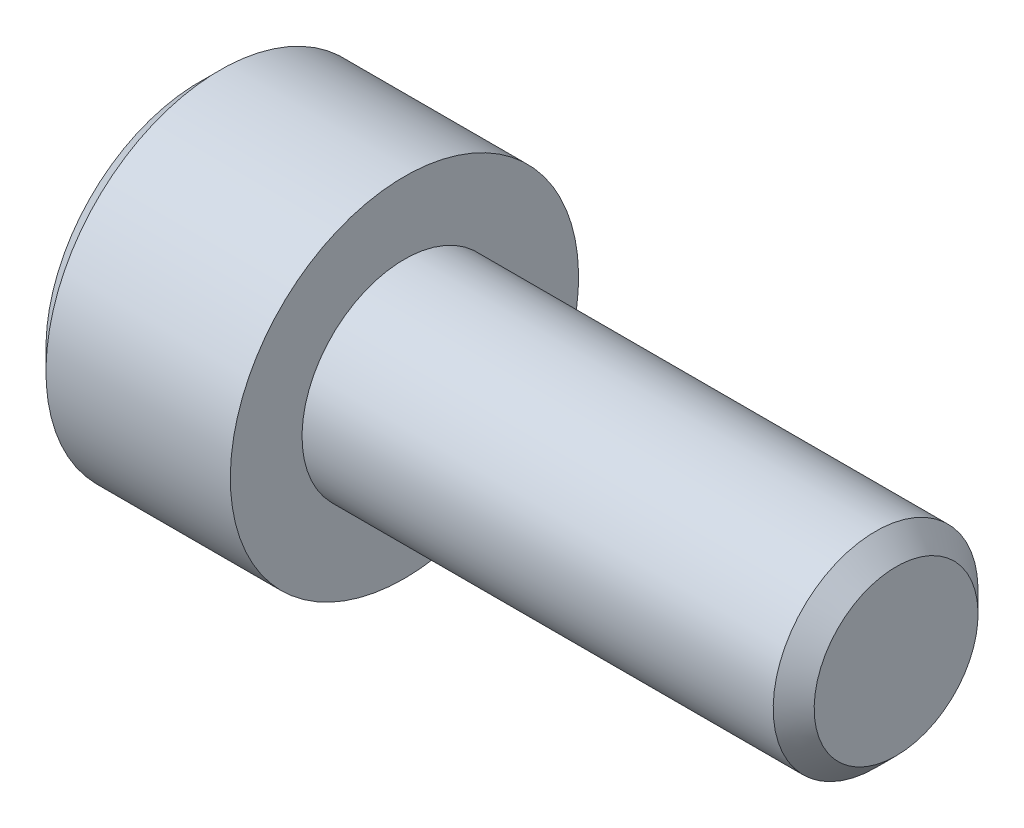
ISO-10303-21;
HEADER;
FILE_DESCRIPTION(('STEP AP214'),'2;1');
FILE_NAME('part.step','',(''),(''),'','','');
FILE_SCHEMA(('AUTOMOTIVE_DESIGN { 1 0 10303 214 1 1 1 1 }'));
ENDSEC;
DATA;
#1=APPLICATION_CONTEXT('core data for automotive mechanical design processes');
#2=APPLICATION_PROTOCOL_DEFINITION('international standard','automotive_design',2000,#1);
#3=PRODUCT_CONTEXT('',#1,'mechanical');
#4=PRODUCT('Part','Part','',(#3));
#5=PRODUCT_RELATED_PRODUCT_CATEGORY('part','',(#4));
#6=PRODUCT_DEFINITION_FORMATION('','',#4);
#7=PRODUCT_DEFINITION_CONTEXT('part definition',#1,'design');
#8=PRODUCT_DEFINITION('design','',#6,#7);
#9=PRODUCT_DEFINITION_SHAPE('','',#8);
#10=(LENGTH_UNIT() NAMED_UNIT(*) SI_UNIT(.MILLI.,.METRE.));
#11=(NAMED_UNIT(*) PLANE_ANGLE_UNIT() SI_UNIT($,.RADIAN.));
#12=(NAMED_UNIT(*) SI_UNIT($,.STERADIAN.) SOLID_ANGLE_UNIT());
#13=UNCERTAINTY_MEASURE_WITH_UNIT(LENGTH_MEASURE(1.E-05),#10,'distance_accuracy_value','');
#14=(GEOMETRIC_REPRESENTATION_CONTEXT(3) GLOBAL_UNCERTAINTY_ASSIGNED_CONTEXT((#13)) GLOBAL_UNIT_ASSIGNED_CONTEXT((#10,
#11,#12)) REPRESENTATION_CONTEXT('',''));
#15=CARTESIAN_POINT('',(0.,0.,0.));
#16=DIRECTION('',(0.,0.,1.));
#17=DIRECTION('',(1.,0.,0.));
#18=AXIS2_PLACEMENT_3D('',#15,#16,#17);
#19=CARTESIAN_POINT('',(-5.,0.,0.));
#20=DIRECTION('',(1.,0.,0.));
#21=DIRECTION('',(0.,1.,0.));
#22=AXIS2_PLACEMENT_3D('',#19,#20,#21);
#23=PLANE('',#22);
#24=CARTESIAN_POINT('',(-5.,0.,0.));
#25=DIRECTION('',(-1.,0.,0.));
#26=DIRECTION('',(0.,-1.,0.));
#27=AXIS2_PLACEMENT_3D('',#24,#25,#26);
#28=CIRCLE('',#27,3.75);
#29=CARTESIAN_POINT('',(-5.,-3.75,0.));
#30=VERTEX_POINT('',#29);
#31=EDGE_CURVE('E158',#30,#30,#28,.T.);
#32=ORIENTED_EDGE('',*,*,#31,.T.);
#33=EDGE_LOOP('',(#32));
#34=FACE_BOUND('',#33,.T.);
#35=DIRECTION('',(0.,-0.499999999999983,-0.866025403784448));
#36=VECTOR('',#35,1.);
#37=CARTESIAN_POINT('',(-5.,-1.1547005383793,2.));
#38=LINE('',#37,#36);
#39=CARTESIAN_POINT('',(-5.,-1.1547005383793,2.));
#40=VERTEX_POINT('',#39);
#41=CARTESIAN_POINT('',(-5.,-2.3094010767585,0.));
#42=VERTEX_POINT('',#41);
#43=EDGE_CURVE('E274',#40,#42,#38,.T.);
#44=ORIENTED_EDGE('',*,*,#43,.T.);
#45=DIRECTION('',(0.,0.499999999999983,-0.866025403784448));
#46=VECTOR('',#45,1.);
#47=CARTESIAN_POINT('',(-5.,-2.3094010767585,0.));
#48=LINE('',#47,#46);
#49=CARTESIAN_POINT('',(-5.,-1.1547005383793,-2.));
#50=VERTEX_POINT('',#49);
#51=EDGE_CURVE('E276',#42,#50,#48,.T.);
#52=ORIENTED_EDGE('',*,*,#51,.T.);
#53=DIRECTION('',(0.,1.,0.));
#54=VECTOR('',#53,1.);
#55=CARTESIAN_POINT('',(-5.,-1.1547005383793,-2.));
#56=LINE('',#55,#54);
#57=CARTESIAN_POINT('',(-5.,1.1547005383793,-2.));
#58=VERTEX_POINT('',#57);
#59=EDGE_CURVE('E278',#50,#58,#56,.T.);
#60=ORIENTED_EDGE('',*,*,#59,.T.);
#61=DIRECTION('',(0.,0.499999999999983,0.866025403784448));
#62=VECTOR('',#61,1.);
#63=CARTESIAN_POINT('',(-5.,1.1547005383793,-2.));
#64=LINE('',#63,#62);
#65=CARTESIAN_POINT('',(-5.,2.3094010767585,0.));
#66=VERTEX_POINT('',#65);
#67=EDGE_CURVE('E123',#58,#66,#64,.T.);
#68=ORIENTED_EDGE('',*,*,#67,.T.);
#69=DIRECTION('',(0.,-0.499999999999983,0.866025403784448));
#70=VECTOR('',#69,1.);
#71=CARTESIAN_POINT('',(-5.,2.3094010767585,0.));
#72=LINE('',#71,#70);
#73=CARTESIAN_POINT('',(-5.,1.1547005383793,2.));
#74=VERTEX_POINT('',#73);
#75=EDGE_CURVE('E271',#66,#74,#72,.T.);
#76=ORIENTED_EDGE('',*,*,#75,.T.);
#77=DIRECTION('',(0.,-1.,0.));
#78=VECTOR('',#77,1.);
#79=CARTESIAN_POINT('',(-5.,1.1547005383793,2.));
#80=LINE('',#79,#78);
#81=EDGE_CURVE('E138',#74,#40,#80,.T.);
#82=ORIENTED_EDGE('',*,*,#81,.T.);
#83=EDGE_LOOP('',(#44,#52,#60,#68,#76,#82));
#84=FACE_BOUND('',#83,.T.);
#85=ADVANCED_FACE('F39',(#34,#84),#23,.F.);
#86=CARTESIAN_POINT('',(-4.5,0.,0.));
#87=DIRECTION('',(1.,0.,0.));
#88=DIRECTION('',(0.,1.,0.));
#89=AXIS2_PLACEMENT_3D('',#86,#87,#88);
#90=CONICAL_SURFACE('',#89,4.25,0.785398163397448);
#91=ORIENTED_EDGE('',*,*,#31,.F.);
#92=EDGE_LOOP('',(#91));
#93=FACE_BOUND('',#92,.T.);
#94=CARTESIAN_POINT('',(-4.5,0.,0.));
#95=DIRECTION('',(-1.,0.,0.));
#96=DIRECTION('',(0.,-1.,0.));
#97=AXIS2_PLACEMENT_3D('',#94,#95,#96);
#98=CIRCLE('',#97,4.25);
#99=CARTESIAN_POINT('',(-4.5,-4.25,0.));
#100=VERTEX_POINT('',#99);
#101=EDGE_CURVE('E155',#100,#100,#98,.T.);
#102=ORIENTED_EDGE('',*,*,#101,.T.);
#103=EDGE_LOOP('',(#102));
#104=FACE_BOUND('',#103,.T.);
#105=ADVANCED_FACE('F178',(#93,#104),#90,.T.);
#106=CARTESIAN_POINT('',(12.,0.,0.));
#107=DIRECTION('',(-1.,0.,0.));
#108=DIRECTION('',(0.,-1.,0.));
#109=AXIS2_PLACEMENT_3D('',#106,#107,#108);
#110=CYLINDRICAL_SURFACE('',#109,4.25);
#111=ORIENTED_EDGE('',*,*,#101,.F.);
#112=EDGE_LOOP('',(#111));
#113=FACE_BOUND('',#112,.T.);
#114=CARTESIAN_POINT('',(0.,0.,0.));
#115=DIRECTION('',(-1.,0.,0.));
#116=DIRECTION('',(0.,-1.,0.));
#117=AXIS2_PLACEMENT_3D('',#114,#115,#116);
#118=CIRCLE('',#117,4.25);
#119=CARTESIAN_POINT('',(0.,-4.25,0.));
#120=VERTEX_POINT('',#119);
#121=EDGE_CURVE('E152',#120,#120,#118,.T.);
#122=ORIENTED_EDGE('',*,*,#121,.T.);
#123=EDGE_LOOP('',(#122));
#124=FACE_BOUND('',#123,.T.);
#125=ADVANCED_FACE('F183',(#113,#124),#110,.T.);
#126=CARTESIAN_POINT('',(0.,4.25,0.));
#127=DIRECTION('',(-1.,0.,0.));
#128=DIRECTION('',(0.,-1.,0.));
#129=AXIS2_PLACEMENT_3D('',#126,#127,#128);
#130=PLANE('',#129);
#131=ORIENTED_EDGE('',*,*,#121,.F.);
#132=EDGE_LOOP('',(#131));
#133=FACE_BOUND('',#132,.T.);
#134=CARTESIAN_POINT('',(0.,0.,0.));
#135=DIRECTION('',(-1.,0.,0.));
#136=DIRECTION('',(0.,-1.,0.));
#137=AXIS2_PLACEMENT_3D('',#134,#135,#136);
#138=CIRCLE('',#137,2.5);
#139=CARTESIAN_POINT('',(0.,-2.5,0.));
#140=VERTEX_POINT('',#139);
#141=EDGE_CURVE('E148',#140,#140,#138,.T.);
#142=ORIENTED_EDGE('',*,*,#141,.T.);
#143=EDGE_LOOP('',(#142));
#144=FACE_BOUND('',#143,.T.);
#145=ADVANCED_FACE('F190',(#133,#144),#130,.F.);
#146=CARTESIAN_POINT('',(12.,0.,0.));
#147=DIRECTION('',(-1.,0.,0.));
#148=DIRECTION('',(0.,-1.,0.));
#149=AXIS2_PLACEMENT_3D('',#146,#147,#148);
#150=CYLINDRICAL_SURFACE('',#149,2.5);
#151=CARTESIAN_POINT('',(11.5,0.,0.));
#152=DIRECTION('',(-1.,0.,0.));
#153=DIRECTION('',(0.,-1.,0.));
#154=AXIS2_PLACEMENT_3D('',#151,#152,#153);
#155=CIRCLE('',#154,2.5);
#156=CARTESIAN_POINT('',(11.5,-2.5,0.));
#157=VERTEX_POINT('',#156);
#158=EDGE_CURVE('E47',#157,#157,#155,.T.);
#159=ORIENTED_EDGE('',*,*,#158,.T.);
#160=EDGE_LOOP('',(#159));
#161=FACE_BOUND('',#160,.T.);
#162=ORIENTED_EDGE('',*,*,#141,.F.);
#163=EDGE_LOOP('',(#162));
#164=FACE_BOUND('',#163,.T.);
#165=ADVANCED_FACE('F163',(#161,#164),#150,.T.);
#166=CARTESIAN_POINT('',(12.,2.5,0.));
#167=DIRECTION('',(-1.,0.,0.));
#168=DIRECTION('',(0.,-1.,0.));
#169=AXIS2_PLACEMENT_3D('',#166,#167,#168);
#170=PLANE('',#169);
#171=CARTESIAN_POINT('',(12.,0.,0.));
#172=DIRECTION('',(-1.,0.,0.));
#173=DIRECTION('',(0.,-1.,0.));
#174=AXIS2_PLACEMENT_3D('',#171,#172,#173);
#175=CIRCLE('',#174,2.);
#176=CARTESIAN_POINT('',(12.,-2.,0.));
#177=VERTEX_POINT('',#176);
#178=EDGE_CURVE('E11',#177,#177,#175,.F.);
#179=ORIENTED_EDGE('',*,*,#178,.T.);
#180=EDGE_LOOP('',(#179));
#181=FACE_BOUND('',#180,.T.);
#182=ADVANCED_FACE('F167',(#181),#170,.F.);
#183=CARTESIAN_POINT('',(11.5,0.,0.));
#184=DIRECTION('',(-1.,0.,0.));
#185=DIRECTION('',(0.,-1.,0.));
#186=AXIS2_PLACEMENT_3D('',#183,#184,#185);
#187=CONICAL_SURFACE('',#186,2.5,0.78539816339745);
#188=ORIENTED_EDGE('',*,*,#178,.F.);
#189=EDGE_LOOP('',(#188));
#190=FACE_BOUND('',#189,.T.);
#191=ORIENTED_EDGE('',*,*,#158,.F.);
#192=EDGE_LOOP('',(#191));
#193=FACE_BOUND('',#192,.T.);
#194=ADVANCED_FACE('F41',(#190,#193),#187,.T.);
#195=CARTESIAN_POINT('',(-2.5,2.3094010767585,0.));
#196=DIRECTION('',(0.,-0.866025403784448,-0.499999999999983));
#197=DIRECTION('',(0.,0.499999999999983,-0.866025403784448));
#198=AXIS2_PLACEMENT_3D('',#195,#196,#197);
#199=PLANE('',#198);
#200=DIRECTION('',(0.,-0.499999999999983,0.866025403784448));
#201=VECTOR('',#200,1.);
#202=CARTESIAN_POINT('',(-2.5,2.3094010767585,0.));
#203=LINE('',#202,#201);
#204=CARTESIAN_POINT('',(-2.5,2.3094010767585,0.));
#205=VERTEX_POINT('',#204);
#206=CARTESIAN_POINT('',(-2.5,1.73205080756891,0.999999999999976));
#207=VERTEX_POINT('',#206);
#208=EDGE_CURVE('E120',#205,#207,#203,.T.);
#209=ORIENTED_EDGE('',*,*,#208,.T.);
#210=CARTESIAN_POINT('',(-2.5,1.1547005383793,2.));
#211=VERTEX_POINT('',#210);
#212=EDGE_CURVE('E112',#207,#211,#203,.T.);
#213=ORIENTED_EDGE('',*,*,#212,.T.);
#214=DIRECTION('',(-1.,0.,0.));
#215=VECTOR('',#214,1.);
#216=CARTESIAN_POINT('',(-2.5,1.1547005383793,2.));
#217=LINE('',#216,#215);
#218=EDGE_CURVE('E117',#211,#74,#217,.T.);
#219=ORIENTED_EDGE('',*,*,#218,.T.);
#220=ORIENTED_EDGE('',*,*,#75,.F.);
#221=DIRECTION('',(-1.,0.,0.));
#222=VECTOR('',#221,1.);
#223=CARTESIAN_POINT('',(-2.5,2.3094010767585,0.));
#224=LINE('',#223,#222);
#225=EDGE_CURVE('E255',#205,#66,#224,.T.);
#226=ORIENTED_EDGE('',*,*,#225,.F.);
#227=EDGE_LOOP('',(#209,#213,#219,#220,#226));
#228=FACE_BOUND('',#227,.T.);
#229=ADVANCED_FACE('F114',(#228),#199,.T.);
#230=CARTESIAN_POINT('',(-2.5,1.1547005383793,2.));
#231=DIRECTION('',(0.,0.,-1.));
#232=DIRECTION('',(-1.,0.,0.));
#233=AXIS2_PLACEMENT_3D('',#230,#231,#232);
#234=PLANE('',#233);
#235=DIRECTION('',(0.,-1.,0.));
#236=VECTOR('',#235,1.);
#237=CARTESIAN_POINT('',(-2.5,1.1547005383793,2.));
#238=LINE('',#237,#236);
#239=CARTESIAN_POINT('',(-2.5,0.,2.));
#240=VERTEX_POINT('',#239);
#241=EDGE_CURVE('E126',#211,#240,#238,.T.);
#242=ORIENTED_EDGE('',*,*,#241,.T.);
#243=CARTESIAN_POINT('',(-2.5,-1.1547005383793,2.));
#244=VERTEX_POINT('',#243);
#245=EDGE_CURVE('E133',#240,#244,#238,.T.);
#246=ORIENTED_EDGE('',*,*,#245,.T.);
#247=DIRECTION('',(-1.,0.,0.));
#248=VECTOR('',#247,1.);
#249=CARTESIAN_POINT('',(-2.5,-1.1547005383793,2.));
#250=LINE('',#249,#248);
#251=EDGE_CURVE('E140',#244,#40,#250,.T.);
#252=ORIENTED_EDGE('',*,*,#251,.T.);
#253=ORIENTED_EDGE('',*,*,#81,.F.);
#254=ORIENTED_EDGE('',*,*,#218,.F.);
#255=EDGE_LOOP('',(#242,#246,#252,#253,#254));
#256=FACE_BOUND('',#255,.T.);
#257=ADVANCED_FACE('F136',(#256),#234,.T.);
#258=CARTESIAN_POINT('',(-2.5,-1.1547005383793,2.));
#259=DIRECTION('',(0.,0.866025403784448,-0.499999999999983));
#260=DIRECTION('',(0.,0.499999999999983,0.866025403784448));
#261=AXIS2_PLACEMENT_3D('',#258,#259,#260);
#262=PLANE('',#261);
#263=DIRECTION('',(0.,-0.499999999999983,-0.866025403784448));
#264=VECTOR('',#263,1.);
#265=CARTESIAN_POINT('',(-2.5,-1.1547005383793,2.));
#266=LINE('',#265,#264);
#267=CARTESIAN_POINT('',(-2.5,-1.73205080756891,0.999999999999976));
#268=VERTEX_POINT('',#267);
#269=EDGE_CURVE('E262',#244,#268,#266,.T.);
#270=ORIENTED_EDGE('',*,*,#269,.T.);
#271=CARTESIAN_POINT('',(-2.5,-2.3094010767585,0.));
#272=VERTEX_POINT('',#271);
#273=EDGE_CURVE('E132',#268,#272,#266,.T.);
#274=ORIENTED_EDGE('',*,*,#273,.T.);
#275=DIRECTION('',(-1.,0.,0.));
#276=VECTOR('',#275,1.);
#277=CARTESIAN_POINT('',(-2.5,-2.3094010767585,0.));
#278=LINE('',#277,#276);
#279=EDGE_CURVE('E144',#272,#42,#278,.T.);
#280=ORIENTED_EDGE('',*,*,#279,.T.);
#281=ORIENTED_EDGE('',*,*,#43,.F.);
#282=ORIENTED_EDGE('',*,*,#251,.F.);
#283=EDGE_LOOP('',(#270,#274,#280,#281,#282));
#284=FACE_BOUND('',#283,.T.);
#285=ADVANCED_FACE('F204',(#284),#262,.T.);
#286=CARTESIAN_POINT('',(-2.5,-2.3094010767585,0.));
#287=DIRECTION('',(0.,0.866025403784448,0.499999999999983));
#288=DIRECTION('',(0.,-0.499999999999983,0.866025403784448));
#289=AXIS2_PLACEMENT_3D('',#286,#287,#288);
#290=PLANE('',#289);
#291=DIRECTION('',(0.,0.499999999999983,-0.866025403784448));
#292=VECTOR('',#291,1.);
#293=CARTESIAN_POINT('',(-2.5,-2.3094010767585,0.));
#294=LINE('',#293,#292);
#295=CARTESIAN_POINT('',(-2.5,-1.7320508075689,-0.999999999999967));
#296=VERTEX_POINT('',#295);
#297=EDGE_CURVE('E54',#272,#296,#294,.T.);
#298=ORIENTED_EDGE('',*,*,#297,.T.);
#299=CARTESIAN_POINT('',(-2.5,-1.1547005383793,-2.));
#300=VERTEX_POINT('',#299);
#301=EDGE_CURVE('E267',#296,#300,#294,.T.);
#302=ORIENTED_EDGE('',*,*,#301,.T.);
#303=DIRECTION('',(-1.,0.,0.));
#304=VECTOR('',#303,1.);
#305=CARTESIAN_POINT('',(-2.5,-1.1547005383793,-2.));
#306=LINE('',#305,#304);
#307=EDGE_CURVE('E283',#300,#50,#306,.T.);
#308=ORIENTED_EDGE('',*,*,#307,.T.);
#309=ORIENTED_EDGE('',*,*,#51,.F.);
#310=ORIENTED_EDGE('',*,*,#279,.F.);
#311=EDGE_LOOP('',(#298,#302,#308,#309,#310));
#312=FACE_BOUND('',#311,.T.);
#313=ADVANCED_FACE('F207',(#312),#290,.T.);
#314=CARTESIAN_POINT('',(-2.5,-1.1547005383793,-2.));
#315=DIRECTION('',(0.,0.,1.));
#316=DIRECTION('',(1.,0.,0.));
#317=AXIS2_PLACEMENT_3D('',#314,#315,#316);
#318=PLANE('',#317);
#319=DIRECTION('',(0.,1.,0.));
#320=VECTOR('',#319,1.);
#321=CARTESIAN_POINT('',(-2.5,-1.1547005383793,-2.));
#322=LINE('',#321,#320);
#323=CARTESIAN_POINT('',(-2.5,0.,-2.));
#324=VERTEX_POINT('',#323);
#325=EDGE_CURVE('E249',#300,#324,#322,.T.);
#326=ORIENTED_EDGE('',*,*,#325,.T.);
#327=CARTESIAN_POINT('',(-2.5,1.1547005383793,-2.));
#328=VERTEX_POINT('',#327);
#329=EDGE_CURVE('E242',#324,#328,#322,.T.);
#330=ORIENTED_EDGE('',*,*,#329,.T.);
#331=DIRECTION('',(-1.,0.,0.));
#332=VECTOR('',#331,1.);
#333=CARTESIAN_POINT('',(-2.5,1.1547005383793,-2.));
#334=LINE('',#333,#332);
#335=EDGE_CURVE('E254',#328,#58,#334,.T.);
#336=ORIENTED_EDGE('',*,*,#335,.T.);
#337=ORIENTED_EDGE('',*,*,#59,.F.);
#338=ORIENTED_EDGE('',*,*,#307,.F.);
#339=EDGE_LOOP('',(#326,#330,#336,#337,#338));
#340=FACE_BOUND('',#339,.T.);
#341=ADVANCED_FACE('F211',(#340),#318,.T.);
#342=CARTESIAN_POINT('',(-2.5,1.1547005383793,-2.));
#343=DIRECTION('',(0.,-0.866025403784448,0.499999999999983));
#344=DIRECTION('',(0.,-0.499999999999983,-0.866025403784448));
#345=AXIS2_PLACEMENT_3D('',#342,#343,#344);
#346=PLANE('',#345);
#347=DIRECTION('',(0.,0.499999999999983,0.866025403784448));
#348=VECTOR('',#347,1.);
#349=CARTESIAN_POINT('',(-2.5,1.1547005383793,-2.));
#350=LINE('',#349,#348);
#351=CARTESIAN_POINT('',(-2.5,1.73205080756891,-0.999999999999976));
#352=VERTEX_POINT('',#351);
#353=EDGE_CURVE('E241',#328,#352,#350,.T.);
#354=ORIENTED_EDGE('',*,*,#353,.T.);
#355=EDGE_CURVE('E247',#352,#205,#350,.T.);
#356=ORIENTED_EDGE('',*,*,#355,.T.);
#357=ORIENTED_EDGE('',*,*,#225,.T.);
#358=ORIENTED_EDGE('',*,*,#67,.F.);
#359=ORIENTED_EDGE('',*,*,#335,.F.);
#360=EDGE_LOOP('',(#354,#356,#357,#358,#359));
#361=FACE_BOUND('',#360,.T.);
#362=ADVANCED_FACE('F214',(#361),#346,.T.);
#363=CARTESIAN_POINT('',(-2.5,1.1547005383793,2.));
#364=DIRECTION('',(1.,0.,0.));
#365=DIRECTION('',(0.,0.,-1.));
#366=AXIS2_PLACEMENT_3D('',#363,#364,#365);
#367=PLANE('',#366);
#368=CARTESIAN_POINT('',(-2.5,0.,0.));
#369=DIRECTION('',(-1.,0.,0.));
#370=DIRECTION('',(0.,0.,1.));
#371=AXIS2_PLACEMENT_3D('',#368,#369,#370);
#372=CIRCLE('',#371,2.);
#373=EDGE_CURVE('E238',#352,#324,#372,.T.);
#374=ORIENTED_EDGE('',*,*,#373,.F.);
#375=ORIENTED_EDGE('',*,*,#353,.F.);
#376=ORIENTED_EDGE('',*,*,#329,.F.);
#377=EDGE_LOOP('',(#374,#375,#376));
#378=FACE_BOUND('',#377,.T.);
#379=ADVANCED_FACE('F218',(#378),#367,.F.);
#380=EDGE_CURVE('E149',#207,#352,#372,.T.);
#381=ORIENTED_EDGE('',*,*,#380,.F.);
#382=ORIENTED_EDGE('',*,*,#208,.F.);
#383=ORIENTED_EDGE('',*,*,#355,.F.);
#384=EDGE_LOOP('',(#381,#382,#383));
#385=FACE_BOUND('',#384,.T.);
#386=ADVANCED_FACE('F229',(#385),#367,.F.);
#387=EDGE_CURVE('E128',#240,#207,#372,.T.);
#388=ORIENTED_EDGE('',*,*,#387,.F.);
#389=ORIENTED_EDGE('',*,*,#241,.F.);
#390=ORIENTED_EDGE('',*,*,#212,.F.);
#391=EDGE_LOOP('',(#388,#389,#390));
#392=FACE_BOUND('',#391,.T.);
#393=ADVANCED_FACE('F127',(#392),#367,.F.);
#394=EDGE_CURVE('E139',#268,#240,#372,.T.);
#395=ORIENTED_EDGE('',*,*,#394,.F.);
#396=ORIENTED_EDGE('',*,*,#269,.F.);
#397=ORIENTED_EDGE('',*,*,#245,.F.);
#398=EDGE_LOOP('',(#395,#396,#397));
#399=FACE_BOUND('',#398,.T.);
#400=ADVANCED_FACE('F226',(#399),#367,.F.);
#401=EDGE_CURVE('E142',#296,#268,#372,.T.);
#402=ORIENTED_EDGE('',*,*,#401,.F.);
#403=ORIENTED_EDGE('',*,*,#297,.F.);
#404=ORIENTED_EDGE('',*,*,#273,.F.);
#405=EDGE_LOOP('',(#402,#403,#404));
#406=FACE_BOUND('',#405,.T.);
#407=ADVANCED_FACE('F221',(#406),#367,.F.);
#408=EDGE_CURVE('E246',#324,#296,#372,.T.);
#409=ORIENTED_EDGE('',*,*,#408,.F.);
#410=ORIENTED_EDGE('',*,*,#325,.F.);
#411=ORIENTED_EDGE('',*,*,#301,.F.);
#412=EDGE_LOOP('',(#409,#410,#411));
#413=FACE_BOUND('',#412,.T.);
#414=ADVANCED_FACE('F199',(#413),#367,.F.);
#415=CARTESIAN_POINT('',(-1.9641016151378,0.,0.));
#416=DIRECTION('',(-1.,0.,0.));
#417=DIRECTION('',(0.,0.,1.));
#418=AXIS2_PLACEMENT_3D('',#415,#416,#417);
#419=CONICAL_SURFACE('',#418,0.,1.30899693899577);
#420=ORIENTED_EDGE('',*,*,#387,.T.);
#421=ORIENTED_EDGE('',*,*,#380,.T.);
#422=ORIENTED_EDGE('',*,*,#373,.T.);
#423=ORIENTED_EDGE('',*,*,#408,.T.);
#424=ORIENTED_EDGE('',*,*,#401,.T.);
#425=ORIENTED_EDGE('',*,*,#394,.T.);
#426=EDGE_LOOP('',(#420,#421,#422,#423,#424,#425));
#427=FACE_BOUND('',#426,.T.);
#428=CARTESIAN_POINT('',(-1.9641016151378,0.,0.));
#429=VERTEX_POINT('',#428);
#430=VERTEX_LOOP('',#429);
#431=FACE_BOUND('',#430,.T.);
#432=ADVANCED_FACE('F197',(#427,#431),#419,.F.);
#433=CLOSED_SHELL('',(#85,#105,#125,#145,#165,#182,#194,#229,#257,#285,#313,#341,#362,#379,#386,
#393,#400,#407,#414,#432));
#434=MANIFOLD_SOLID_BREP('B2',#433);
#435=ADVANCED_BREP_SHAPE_REPRESENTATION('',(#18,#434),#14);
#436=SHAPE_DEFINITION_REPRESENTATION(#9,#435);
ENDSEC;
END-ISO-10303-21;
